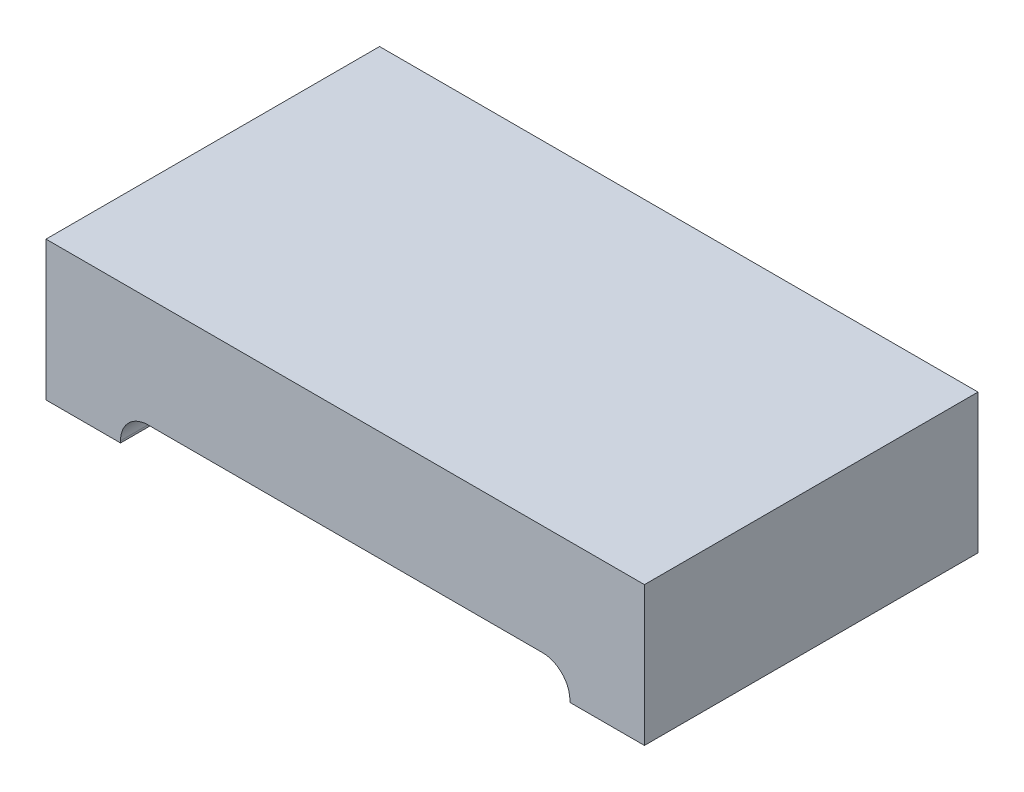
ISO-10303-21;
HEADER;
FILE_DESCRIPTION(('STEP AP214'),'2;1');
FILE_NAME('part.step','',(''),(''),'','','');
FILE_SCHEMA(('AUTOMOTIVE_DESIGN { 1 0 10303 214 1 1 1 1 }'));
ENDSEC;
DATA;
#1=APPLICATION_CONTEXT('core data for automotive mechanical design processes');
#2=APPLICATION_PROTOCOL_DEFINITION('international standard','automotive_design',2000,#1);
#3=PRODUCT_CONTEXT('',#1,'mechanical');
#4=PRODUCT('Part','Part','',(#3));
#5=PRODUCT_RELATED_PRODUCT_CATEGORY('part','',(#4));
#6=PRODUCT_DEFINITION_FORMATION('','',#4);
#7=PRODUCT_DEFINITION_CONTEXT('part definition',#1,'design');
#8=PRODUCT_DEFINITION('design','',#6,#7);
#9=PRODUCT_DEFINITION_SHAPE('','',#8);
#10=(LENGTH_UNIT() NAMED_UNIT(*) SI_UNIT(.MILLI.,.METRE.));
#11=(NAMED_UNIT(*) PLANE_ANGLE_UNIT() SI_UNIT($,.RADIAN.));
#12=(NAMED_UNIT(*) SI_UNIT($,.STERADIAN.) SOLID_ANGLE_UNIT());
#13=UNCERTAINTY_MEASURE_WITH_UNIT(LENGTH_MEASURE(1.E-05),#10,'distance_accuracy_value','');
#14=(GEOMETRIC_REPRESENTATION_CONTEXT(3) GLOBAL_UNCERTAINTY_ASSIGNED_CONTEXT((#13)) GLOBAL_UNIT_ASSIGNED_CONTEXT((#10,
#11,#12)) REPRESENTATION_CONTEXT('',''));
#15=CARTESIAN_POINT('',(0.,0.,0.));
#16=DIRECTION('',(0.,0.,1.));
#17=DIRECTION('',(1.,0.,0.));
#18=AXIS2_PLACEMENT_3D('',#15,#16,#17);
#19=CARTESIAN_POINT('',(0.,0.,0.));
#20=DIRECTION('',(0.,-1.,0.));
#21=DIRECTION('',(0.,0.,-1.));
#22=AXIS2_PLACEMENT_3D('',#19,#20,#21);
#23=PLANE('',#22);
#24=DIRECTION('',(0.,0.,1.));
#25=VECTOR('',#24,1.);
#26=CARTESIAN_POINT('',(-1.145,0.,-0.85));
#27=LINE('',#26,#25);
#28=CARTESIAN_POINT('',(-1.145,0.,-0.85));
#29=VERTEX_POINT('',#28);
#30=CARTESIAN_POINT('',(-1.145,0.,0.85));
#31=VERTEX_POINT('',#30);
#32=EDGE_CURVE('E122',#29,#31,#27,.T.);
#33=ORIENTED_EDGE('',*,*,#32,.T.);
#34=DIRECTION('',(1.,0.,0.));
#35=VECTOR('',#34,1.);
#36=CARTESIAN_POINT('',(-1.525,0.,0.85));
#37=LINE('',#36,#35);
#38=CARTESIAN_POINT('',(-1.525,0.,0.85));
#39=VERTEX_POINT('',#38);
#40=EDGE_CURVE('E134',#39,#31,#37,.T.);
#41=ORIENTED_EDGE('',*,*,#40,.F.);
#42=DIRECTION('',(0.,0.,1.));
#43=VECTOR('',#42,1.);
#44=CARTESIAN_POINT('',(-1.525,0.,0.85));
#45=LINE('',#44,#43);
#46=CARTESIAN_POINT('',(-1.525,0.,-0.85));
#47=VERTEX_POINT('',#46);
#48=EDGE_CURVE('E146',#47,#39,#45,.T.);
#49=ORIENTED_EDGE('',*,*,#48,.F.);
#50=DIRECTION('',(-1.,0.,0.));
#51=VECTOR('',#50,1.);
#52=CARTESIAN_POINT('',(-1.525,0.,-0.85));
#53=LINE('',#52,#51);
#54=EDGE_CURVE('E135',#29,#47,#53,.T.);
#55=ORIENTED_EDGE('',*,*,#54,.F.);
#56=EDGE_LOOP('',(#33,#41,#49,#55));
#57=FACE_BOUND('',#56,.T.);
#58=ADVANCED_FACE('F33',(#57),#23,.T.);
#59=CARTESIAN_POINT('',(1.525,0.71,0.85));
#60=DIRECTION('',(-1.,0.,0.));
#61=DIRECTION('',(0.,0.,1.));
#62=AXIS2_PLACEMENT_3D('',#59,#60,#61);
#63=PLANE('',#62);
#64=DIRECTION('',(0.,0.,-1.));
#65=VECTOR('',#64,1.);
#66=CARTESIAN_POINT('',(1.525,0.,0.85));
#67=LINE('',#66,#65);
#68=CARTESIAN_POINT('',(1.525,0.,0.85));
#69=VERTEX_POINT('',#68);
#70=CARTESIAN_POINT('',(1.525,0.,-0.85));
#71=VERTEX_POINT('',#70);
#72=EDGE_CURVE('E159',#69,#71,#67,.T.);
#73=ORIENTED_EDGE('',*,*,#72,.T.);
#74=DIRECTION('',(0.,-1.,0.));
#75=VECTOR('',#74,1.);
#76=CARTESIAN_POINT('',(1.525,0.71,-0.85));
#77=LINE('',#76,#75);
#78=CARTESIAN_POINT('',(1.525,0.71,-0.85));
#79=VERTEX_POINT('',#78);
#80=EDGE_CURVE('E11',#79,#71,#77,.T.);
#81=ORIENTED_EDGE('',*,*,#80,.F.);
#82=DIRECTION('',(0.,0.,-1.));
#83=VECTOR('',#82,1.);
#84=CARTESIAN_POINT('',(1.525,0.71,0.85));
#85=LINE('',#84,#83);
#86=CARTESIAN_POINT('',(1.525,0.71,0.85));
#87=VERTEX_POINT('',#86);
#88=EDGE_CURVE('E143',#87,#79,#85,.T.);
#89=ORIENTED_EDGE('',*,*,#88,.F.);
#90=DIRECTION('',(0.,-1.,0.));
#91=VECTOR('',#90,1.);
#92=CARTESIAN_POINT('',(1.525,0.71,0.85));
#93=LINE('',#92,#91);
#94=EDGE_CURVE('E150',#87,#69,#93,.T.);
#95=ORIENTED_EDGE('',*,*,#94,.T.);
#96=EDGE_LOOP('',(#73,#81,#89,#95));
#97=FACE_BOUND('',#96,.T.);
#98=ADVANCED_FACE('F35',(#97),#63,.F.);
#99=CARTESIAN_POINT('',(-1.525,0.71,-0.85));
#100=DIRECTION('',(0.,0.,1.));
#101=DIRECTION('',(1.,0.,0.));
#102=AXIS2_PLACEMENT_3D('',#99,#100,#101);
#103=PLANE('',#102);
#104=CARTESIAN_POINT('',(-1.005,0.01,-0.85));
#105=DIRECTION('',(0.,0.,1.));
#106=DIRECTION('',(-1.,0.,0.));
#107=AXIS2_PLACEMENT_3D('',#104,#105,#106);
#108=CIRCLE('',#107,0.14);
#109=CARTESIAN_POINT('',(-1.005,0.15,-0.85));
#110=VERTEX_POINT('',#109);
#111=CARTESIAN_POINT('',(-1.145,0.009999999999999,-0.85));
#112=VERTEX_POINT('',#111);
#113=EDGE_CURVE('E137',#110,#112,#108,.T.);
#114=ORIENTED_EDGE('',*,*,#113,.T.);
#115=DIRECTION('',(0.,-1.,0.));
#116=VECTOR('',#115,1.);
#117=CARTESIAN_POINT('',(-1.145,0.,-0.85));
#118=LINE('',#117,#116);
#119=EDGE_CURVE('E183',#112,#29,#118,.T.);
#120=ORIENTED_EDGE('',*,*,#119,.T.);
#121=ORIENTED_EDGE('',*,*,#54,.T.);
#122=DIRECTION('',(0.,-1.,0.));
#123=VECTOR('',#122,1.);
#124=CARTESIAN_POINT('',(-1.525,0.71,-0.85));
#125=LINE('',#124,#123);
#126=CARTESIAN_POINT('',(-1.525,0.71,-0.85));
#127=VERTEX_POINT('',#126);
#128=EDGE_CURVE('E41',#127,#47,#125,.T.);
#129=ORIENTED_EDGE('',*,*,#128,.F.);
#130=DIRECTION('',(-1.,0.,0.));
#131=VECTOR('',#130,1.);
#132=CARTESIAN_POINT('',(-1.525,0.71,-0.85));
#133=LINE('',#132,#131);
#134=EDGE_CURVE('E85',#79,#127,#133,.T.);
#135=ORIENTED_EDGE('',*,*,#134,.F.);
#136=ORIENTED_EDGE('',*,*,#80,.T.);
#137=CARTESIAN_POINT('',(1.145,0.,-0.85));
#138=VERTEX_POINT('',#137);
#139=EDGE_CURVE('E157',#71,#138,#53,.T.);
#140=ORIENTED_EDGE('',*,*,#139,.T.);
#141=DIRECTION('',(0.,1.,0.));
#142=VECTOR('',#141,1.);
#143=CARTESIAN_POINT('',(1.145,0.,-0.85));
#144=LINE('',#143,#142);
#145=CARTESIAN_POINT('',(1.145,0.00999999999999938,-0.85));
#146=VERTEX_POINT('',#145);
#147=EDGE_CURVE('E48',#138,#146,#144,.T.);
#148=ORIENTED_EDGE('',*,*,#147,.T.);
#149=CARTESIAN_POINT('',(1.005,0.0100000000000004,-0.85));
#150=DIRECTION('',(0.,0.,1.));
#151=DIRECTION('',(-1.,0.,0.));
#152=AXIS2_PLACEMENT_3D('',#149,#150,#151);
#153=CIRCLE('',#152,0.14);
#154=CARTESIAN_POINT('',(1.005,0.15,-0.85));
#155=VERTEX_POINT('',#154);
#156=EDGE_CURVE('E179',#146,#155,#153,.T.);
#157=ORIENTED_EDGE('',*,*,#156,.T.);
#158=DIRECTION('',(-1.,0.,0.));
#159=VECTOR('',#158,1.);
#160=CARTESIAN_POINT('',(-1.005,0.15,-0.85));
#161=LINE('',#160,#159);
#162=EDGE_CURVE('E176',#155,#110,#161,.T.);
#163=ORIENTED_EDGE('',*,*,#162,.T.);
#164=EDGE_LOOP('',(#114,#120,#121,#129,#135,#136,#140,#148,#157,#163));
#165=FACE_BOUND('',#164,.T.);
#166=ADVANCED_FACE('F201',(#165),#103,.F.);
#167=CARTESIAN_POINT('',(-1.525,0.71,0.85));
#168=DIRECTION('',(1.,0.,0.));
#169=DIRECTION('',(0.,0.,-1.));
#170=AXIS2_PLACEMENT_3D('',#167,#168,#169);
#171=PLANE('',#170);
#172=ORIENTED_EDGE('',*,*,#48,.T.);
#173=DIRECTION('',(0.,-1.,0.));
#174=VECTOR('',#173,1.);
#175=CARTESIAN_POINT('',(-1.525,0.71,0.85));
#176=LINE('',#175,#174);
#177=CARTESIAN_POINT('',(-1.525,0.71,0.85));
#178=VERTEX_POINT('',#177);
#179=EDGE_CURVE('E142',#178,#39,#176,.T.);
#180=ORIENTED_EDGE('',*,*,#179,.F.);
#181=DIRECTION('',(0.,0.,1.));
#182=VECTOR('',#181,1.);
#183=CARTESIAN_POINT('',(-1.525,0.71,0.85));
#184=LINE('',#183,#182);
#185=EDGE_CURVE('E156',#127,#178,#184,.T.);
#186=ORIENTED_EDGE('',*,*,#185,.F.);
#187=ORIENTED_EDGE('',*,*,#128,.T.);
#188=EDGE_LOOP('',(#172,#180,#186,#187));
#189=FACE_BOUND('',#188,.T.);
#190=ADVANCED_FACE('F155',(#189),#171,.F.);
#191=CARTESIAN_POINT('',(-1.525,0.71,0.85));
#192=DIRECTION('',(0.,0.,-1.));
#193=DIRECTION('',(-1.,0.,0.));
#194=AXIS2_PLACEMENT_3D('',#191,#192,#193);
#195=PLANE('',#194);
#196=ORIENTED_EDGE('',*,*,#40,.T.);
#197=DIRECTION('',(0.,-1.,0.));
#198=VECTOR('',#197,1.);
#199=CARTESIAN_POINT('',(-1.145,0.,0.85));
#200=LINE('',#199,#198);
#201=CARTESIAN_POINT('',(-1.145,0.009999999999999,0.85));
#202=VERTEX_POINT('',#201);
#203=EDGE_CURVE('E118',#202,#31,#200,.T.);
#204=ORIENTED_EDGE('',*,*,#203,.F.);
#205=CARTESIAN_POINT('',(-1.005,0.01,0.85));
#206=DIRECTION('',(0.,0.,1.));
#207=DIRECTION('',(-1.,0.,0.));
#208=AXIS2_PLACEMENT_3D('',#205,#206,#207);
#209=CIRCLE('',#208,0.14);
#210=CARTESIAN_POINT('',(-1.005,0.15,0.85));
#211=VERTEX_POINT('',#210);
#212=EDGE_CURVE('E185',#211,#202,#209,.T.);
#213=ORIENTED_EDGE('',*,*,#212,.F.);
#214=DIRECTION('',(-1.,0.,0.));
#215=VECTOR('',#214,1.);
#216=CARTESIAN_POINT('',(-1.005,0.15,0.85));
#217=LINE('',#216,#215);
#218=CARTESIAN_POINT('',(1.005,0.15,0.85));
#219=VERTEX_POINT('',#218);
#220=EDGE_CURVE('E187',#219,#211,#217,.T.);
#221=ORIENTED_EDGE('',*,*,#220,.F.);
#222=CARTESIAN_POINT('',(1.005,0.0100000000000004,0.85));
#223=DIRECTION('',(0.,0.,1.));
#224=DIRECTION('',(-1.,0.,0.));
#225=AXIS2_PLACEMENT_3D('',#222,#223,#224);
#226=CIRCLE('',#225,0.14);
#227=CARTESIAN_POINT('',(1.145,0.00999999999999938,0.85));
#228=VERTEX_POINT('',#227);
#229=EDGE_CURVE('E190',#228,#219,#226,.T.);
#230=ORIENTED_EDGE('',*,*,#229,.F.);
#231=DIRECTION('',(0.,1.,0.));
#232=VECTOR('',#231,1.);
#233=CARTESIAN_POINT('',(1.145,0.,0.85));
#234=LINE('',#233,#232);
#235=CARTESIAN_POINT('',(1.145,0.,0.85));
#236=VERTEX_POINT('',#235);
#237=EDGE_CURVE('E128',#236,#228,#234,.T.);
#238=ORIENTED_EDGE('',*,*,#237,.F.);
#239=EDGE_CURVE('E78',#236,#69,#37,.T.);
#240=ORIENTED_EDGE('',*,*,#239,.T.);
#241=ORIENTED_EDGE('',*,*,#94,.F.);
#242=DIRECTION('',(1.,0.,0.));
#243=VECTOR('',#242,1.);
#244=CARTESIAN_POINT('',(-1.525,0.71,0.85));
#245=LINE('',#244,#243);
#246=EDGE_CURVE('E57',#178,#87,#245,.T.);
#247=ORIENTED_EDGE('',*,*,#246,.F.);
#248=ORIENTED_EDGE('',*,*,#179,.T.);
#249=EDGE_LOOP('',(#196,#204,#213,#221,#230,#238,#240,#241,#247,#248));
#250=FACE_BOUND('',#249,.T.);
#251=ADVANCED_FACE('F140',(#250),#195,.F.);
#252=CARTESIAN_POINT('',(0.,0.71,0.));
#253=DIRECTION('',(0.,-1.,0.));
#254=DIRECTION('',(0.,0.,-1.));
#255=AXIS2_PLACEMENT_3D('',#252,#253,#254);
#256=PLANE('',#255);
#257=ORIENTED_EDGE('',*,*,#88,.T.);
#258=ORIENTED_EDGE('',*,*,#134,.T.);
#259=ORIENTED_EDGE('',*,*,#185,.T.);
#260=ORIENTED_EDGE('',*,*,#246,.T.);
#261=EDGE_LOOP('',(#257,#258,#259,#260));
#262=FACE_BOUND('',#261,.T.);
#263=ADVANCED_FACE('F218',(#262),#256,.F.);
#264=DIRECTION('',(0.,0.,1.));
#265=VECTOR('',#264,1.);
#266=CARTESIAN_POINT('',(1.145,0.,-0.85));
#267=LINE('',#266,#265);
#268=EDGE_CURVE('E136',#138,#236,#267,.T.);
#269=ORIENTED_EDGE('',*,*,#268,.F.);
#270=ORIENTED_EDGE('',*,*,#139,.F.);
#271=ORIENTED_EDGE('',*,*,#72,.F.);
#272=ORIENTED_EDGE('',*,*,#239,.F.);
#273=EDGE_LOOP('',(#269,#270,#271,#272));
#274=FACE_BOUND('',#273,.T.);
#275=ADVANCED_FACE('F212',(#274),#23,.T.);
#276=CARTESIAN_POINT('',(-1.145,0.,-0.85));
#277=DIRECTION('',(-1.,0.,0.));
#278=DIRECTION('',(0.,0.,1.));
#279=AXIS2_PLACEMENT_3D('',#276,#277,#278);
#280=PLANE('',#279);
#281=ORIENTED_EDGE('',*,*,#32,.F.);
#282=ORIENTED_EDGE('',*,*,#119,.F.);
#283=DIRECTION('',(0.,0.,1.));
#284=VECTOR('',#283,1.);
#285=CARTESIAN_POINT('',(-1.145,0.009999999999999,-0.85));
#286=LINE('',#285,#284);
#287=EDGE_CURVE('E124',#112,#202,#286,.T.);
#288=ORIENTED_EDGE('',*,*,#287,.T.);
#289=ORIENTED_EDGE('',*,*,#203,.T.);
#290=EDGE_LOOP('',(#281,#282,#288,#289));
#291=FACE_BOUND('',#290,.T.);
#292=ADVANCED_FACE('F120',(#291),#280,.F.);
#293=CARTESIAN_POINT('',(-1.005,0.01,-0.85));
#294=DIRECTION('',(0.,0.,1.));
#295=DIRECTION('',(1.,0.,0.));
#296=AXIS2_PLACEMENT_3D('',#293,#294,#295);
#297=CYLINDRICAL_SURFACE('',#296,0.14);
#298=ORIENTED_EDGE('',*,*,#287,.F.);
#299=ORIENTED_EDGE('',*,*,#113,.F.);
#300=DIRECTION('',(0.,0.,1.));
#301=VECTOR('',#300,1.);
#302=CARTESIAN_POINT('',(-1.005,0.15,-0.85));
#303=LINE('',#302,#301);
#304=EDGE_CURVE('E171',#110,#211,#303,.T.);
#305=ORIENTED_EDGE('',*,*,#304,.T.);
#306=ORIENTED_EDGE('',*,*,#212,.T.);
#307=EDGE_LOOP('',(#298,#299,#305,#306));
#308=FACE_BOUND('',#307,.T.);
#309=ADVANCED_FACE('F224',(#308),#297,.F.);
#310=CARTESIAN_POINT('',(-1.005,0.15,-0.85));
#311=DIRECTION('',(0.,1.,0.));
#312=DIRECTION('',(-1.,0.,0.));
#313=AXIS2_PLACEMENT_3D('',#310,#311,#312);
#314=PLANE('',#313);
#315=ORIENTED_EDGE('',*,*,#304,.F.);
#316=ORIENTED_EDGE('',*,*,#162,.F.);
#317=DIRECTION('',(0.,0.,1.));
#318=VECTOR('',#317,1.);
#319=CARTESIAN_POINT('',(1.005,0.15,-0.85));
#320=LINE('',#319,#318);
#321=EDGE_CURVE('E169',#155,#219,#320,.T.);
#322=ORIENTED_EDGE('',*,*,#321,.T.);
#323=ORIENTED_EDGE('',*,*,#220,.T.);
#324=EDGE_LOOP('',(#315,#316,#322,#323));
#325=FACE_BOUND('',#324,.T.);
#326=ADVANCED_FACE('F237',(#325),#314,.F.);
#327=CARTESIAN_POINT('',(1.005,0.0100000000000004,-0.85));
#328=DIRECTION('',(0.,0.,1.));
#329=DIRECTION('',(1.,0.,0.));
#330=AXIS2_PLACEMENT_3D('',#327,#328,#329);
#331=CYLINDRICAL_SURFACE('',#330,0.14);
#332=ORIENTED_EDGE('',*,*,#321,.F.);
#333=ORIENTED_EDGE('',*,*,#156,.F.);
#334=DIRECTION('',(0.,0.,1.));
#335=VECTOR('',#334,1.);
#336=CARTESIAN_POINT('',(1.145,0.00999999999999938,-0.85));
#337=LINE('',#336,#335);
#338=EDGE_CURVE('E167',#146,#228,#337,.T.);
#339=ORIENTED_EDGE('',*,*,#338,.T.);
#340=ORIENTED_EDGE('',*,*,#229,.T.);
#341=EDGE_LOOP('',(#332,#333,#339,#340));
#342=FACE_BOUND('',#341,.T.);
#343=ADVANCED_FACE('F199',(#342),#331,.F.);
#344=CARTESIAN_POINT('',(1.145,0.,-0.85));
#345=DIRECTION('',(1.,0.,0.));
#346=DIRECTION('',(0.,0.,-1.));
#347=AXIS2_PLACEMENT_3D('',#344,#345,#346);
#348=PLANE('',#347);
#349=ORIENTED_EDGE('',*,*,#338,.F.);
#350=ORIENTED_EDGE('',*,*,#147,.F.);
#351=ORIENTED_EDGE('',*,*,#268,.T.);
#352=ORIENTED_EDGE('',*,*,#237,.T.);
#353=EDGE_LOOP('',(#349,#350,#351,#352));
#354=FACE_BOUND('',#353,.T.);
#355=ADVANCED_FACE('F195',(#354),#348,.F.);
#356=CLOSED_SHELL('',(#58,#98,#166,#190,#251,#263,#275,#292,#309,#326,#343,#355));
#357=MANIFOLD_SOLID_BREP('B2',#356);
#358=ADVANCED_BREP_SHAPE_REPRESENTATION('',(#18,#357),#14);
#359=SHAPE_DEFINITION_REPRESENTATION(#9,#358);
ENDSEC;
END-ISO-10303-21;
